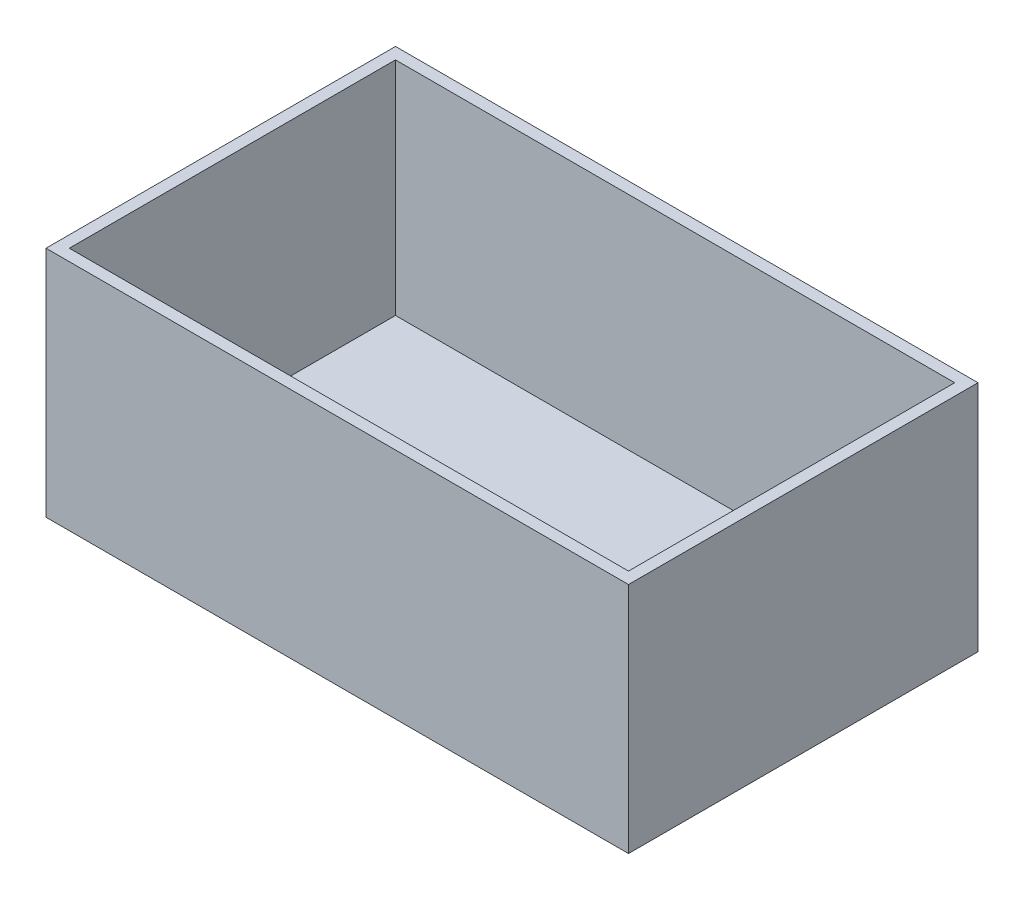
ISO-10303-21;
HEADER;
FILE_DESCRIPTION(('STEP AP214'),'2;1');
FILE_NAME('part.step','',(''),(''),'','','');
FILE_SCHEMA(('AUTOMOTIVE_DESIGN { 1 0 10303 214 1 1 1 1 }'));
ENDSEC;
DATA;
#1=APPLICATION_CONTEXT('core data for automotive mechanical design processes');
#2=APPLICATION_PROTOCOL_DEFINITION('international standard','automotive_design',2000,#1);
#3=PRODUCT_CONTEXT('',#1,'mechanical');
#4=PRODUCT('Part','Part','',(#3));
#5=PRODUCT_RELATED_PRODUCT_CATEGORY('part','',(#4));
#6=PRODUCT_DEFINITION_FORMATION('','',#4);
#7=PRODUCT_DEFINITION_CONTEXT('part definition',#1,'design');
#8=PRODUCT_DEFINITION('design','',#6,#7);
#9=PRODUCT_DEFINITION_SHAPE('','',#8);
#10=(LENGTH_UNIT() NAMED_UNIT(*) SI_UNIT(.MILLI.,.METRE.));
#11=(NAMED_UNIT(*) PLANE_ANGLE_UNIT() SI_UNIT($,.RADIAN.));
#12=(NAMED_UNIT(*) SI_UNIT($,.STERADIAN.) SOLID_ANGLE_UNIT());
#13=UNCERTAINTY_MEASURE_WITH_UNIT(LENGTH_MEASURE(1.E-05),#10,'distance_accuracy_value','');
#14=(GEOMETRIC_REPRESENTATION_CONTEXT(3) GLOBAL_UNCERTAINTY_ASSIGNED_CONTEXT((#13)) GLOBAL_UNIT_ASSIGNED_CONTEXT((#10,
#11,#12)) REPRESENTATION_CONTEXT('',''));
#15=CARTESIAN_POINT('',(0.,0.,0.));
#16=DIRECTION('',(0.,0.,1.));
#17=DIRECTION('',(1.,0.,0.));
#18=AXIS2_PLACEMENT_3D('',#15,#16,#17);
#19=CARTESIAN_POINT('',(-250.,100.,300.));
#20=DIRECTION('',(0.,-1.,0.));
#21=DIRECTION('',(0.,0.,-1.));
#22=AXIS2_PLACEMENT_3D('',#19,#20,#21);
#23=PLANE('',#22);
#24=DIRECTION('',(-1.,0.,0.));
#25=VECTOR('',#24,1.);
#26=CARTESIAN_POINT('',(-250.,100.,0.));
#27=LINE('',#26,#25);
#28=CARTESIAN_POINT('',(250.,100.,0.));
#29=VERTEX_POINT('',#28);
#30=CARTESIAN_POINT('',(-250.,100.,0.));
#31=VERTEX_POINT('',#30);
#32=EDGE_CURVE('E310',#29,#31,#27,.T.);
#33=ORIENTED_EDGE('',*,*,#32,.T.);
#34=DIRECTION('',(0.,0.,-1.));
#35=VECTOR('',#34,1.);
#36=CARTESIAN_POINT('',(-250.,100.,300.));
#37=LINE('',#36,#35);
#38=CARTESIAN_POINT('',(-250.,100.,300.));
#39=VERTEX_POINT('',#38);
#40=EDGE_CURVE('E48',#39,#31,#37,.T.);
#41=ORIENTED_EDGE('',*,*,#40,.F.);
#42=DIRECTION('',(-1.,0.,0.));
#43=VECTOR('',#42,1.);
#44=CARTESIAN_POINT('',(-250.,100.,300.));
#45=LINE('',#44,#43);
#46=CARTESIAN_POINT('',(250.,100.,300.));
#47=VERTEX_POINT('',#46);
#48=EDGE_CURVE('E296',#47,#39,#45,.T.);
#49=ORIENTED_EDGE('',*,*,#48,.F.);
#50=DIRECTION('',(0.,0.,-1.));
#51=VECTOR('',#50,1.);
#52=CARTESIAN_POINT('',(250.,100.,300.));
#53=LINE('',#52,#51);
#54=EDGE_CURVE('E11',#47,#29,#53,.T.);
#55=ORIENTED_EDGE('',*,*,#54,.T.);
#56=EDGE_LOOP('',(#33,#41,#49,#55));
#57=FACE_BOUND('',#56,.T.);
#58=DIRECTION('',(-1.,0.,0.));
#59=VECTOR('',#58,1.);
#60=CARTESIAN_POINT('',(0.,100.,10.));
#61=LINE('',#60,#59);
#62=CARTESIAN_POINT('',(240.,100.,10.));
#63=VERTEX_POINT('',#62);
#64=CARTESIAN_POINT('',(-240.,100.,10.));
#65=VERTEX_POINT('',#64);
#66=EDGE_CURVE('E180',#63,#65,#61,.T.);
#67=ORIENTED_EDGE('',*,*,#66,.F.);
#68=DIRECTION('',(0.,0.,-1.));
#69=VECTOR('',#68,1.);
#70=CARTESIAN_POINT('',(240.,100.,300.));
#71=LINE('',#70,#69);
#72=CARTESIAN_POINT('',(240.,100.,290.));
#73=VERTEX_POINT('',#72);
#74=EDGE_CURVE('E178',#73,#63,#71,.T.);
#75=ORIENTED_EDGE('',*,*,#74,.F.);
#76=DIRECTION('',(-1.,0.,0.));
#77=VECTOR('',#76,1.);
#78=CARTESIAN_POINT('',(0.,100.,290.));
#79=LINE('',#78,#77);
#80=CARTESIAN_POINT('',(-240.,100.,290.));
#81=VERTEX_POINT('',#80);
#82=EDGE_CURVE('E186',#73,#81,#79,.T.);
#83=ORIENTED_EDGE('',*,*,#82,.T.);
#84=DIRECTION('',(0.,0.,-1.));
#85=VECTOR('',#84,1.);
#86=CARTESIAN_POINT('',(-240.,100.,300.));
#87=LINE('',#86,#85);
#88=EDGE_CURVE('E193',#81,#65,#87,.T.);
#89=ORIENTED_EDGE('',*,*,#88,.T.);
#90=EDGE_LOOP('',(#67,#75,#83,#89));
#91=FACE_BOUND('',#90,.T.);
#92=ADVANCED_FACE('F39',(#57,#91),#23,.F.);
#93=CARTESIAN_POINT('',(250.,-100.,300.));
#94=DIRECTION('',(-1.,0.,0.));
#95=DIRECTION('',(0.,0.,1.));
#96=AXIS2_PLACEMENT_3D('',#93,#94,#95);
#97=PLANE('',#96);
#98=DIRECTION('',(0.,1.,0.));
#99=VECTOR('',#98,1.);
#100=CARTESIAN_POINT('',(250.,-100.,0.));
#101=LINE('',#100,#99);
#102=CARTESIAN_POINT('',(250.,-100.,0.));
#103=VERTEX_POINT('',#102);
#104=EDGE_CURVE('E268',#103,#29,#101,.T.);
#105=ORIENTED_EDGE('',*,*,#104,.T.);
#106=ORIENTED_EDGE('',*,*,#54,.F.);
#107=DIRECTION('',(0.,1.,0.));
#108=VECTOR('',#107,1.);
#109=CARTESIAN_POINT('',(250.,-100.,300.));
#110=LINE('',#109,#108);
#111=CARTESIAN_POINT('',(250.,-100.,300.));
#112=VERTEX_POINT('',#111);
#113=EDGE_CURVE('E292',#112,#47,#110,.T.);
#114=ORIENTED_EDGE('',*,*,#113,.F.);
#115=DIRECTION('',(0.,0.,-1.));
#116=VECTOR('',#115,1.);
#117=CARTESIAN_POINT('',(250.,-100.,300.));
#118=LINE('',#117,#116);
#119=EDGE_CURVE('E306',#112,#103,#118,.T.);
#120=ORIENTED_EDGE('',*,*,#119,.T.);
#121=EDGE_LOOP('',(#105,#106,#114,#120));
#122=FACE_BOUND('',#121,.T.);
#123=ADVANCED_FACE('F41',(#122),#97,.F.);
#124=CARTESIAN_POINT('',(-250.,-100.,300.));
#125=DIRECTION('',(1.,0.,0.));
#126=DIRECTION('',(0.,0.,-1.));
#127=AXIS2_PLACEMENT_3D('',#124,#125,#126);
#128=PLANE('',#127);
#129=DIRECTION('',(0.,-1.,0.));
#130=VECTOR('',#129,1.);
#131=CARTESIAN_POINT('',(-250.,-100.,0.));
#132=LINE('',#131,#130);
#133=CARTESIAN_POINT('',(-250.,-100.,0.));
#134=VERTEX_POINT('',#133);
#135=EDGE_CURVE('E313',#31,#134,#132,.T.);
#136=ORIENTED_EDGE('',*,*,#135,.T.);
#137=DIRECTION('',(0.,0.,-1.));
#138=VECTOR('',#137,1.);
#139=CARTESIAN_POINT('',(-250.,-100.,300.));
#140=LINE('',#139,#138);
#141=CARTESIAN_POINT('',(-250.,-100.,300.));
#142=VERTEX_POINT('',#141);
#143=EDGE_CURVE('E321',#142,#134,#140,.T.);
#144=ORIENTED_EDGE('',*,*,#143,.F.);
#145=DIRECTION('',(0.,-1.,0.));
#146=VECTOR('',#145,1.);
#147=CARTESIAN_POINT('',(-250.,-100.,300.));
#148=LINE('',#147,#146);
#149=EDGE_CURVE('E300',#39,#142,#148,.T.);
#150=ORIENTED_EDGE('',*,*,#149,.F.);
#151=ORIENTED_EDGE('',*,*,#40,.T.);
#152=EDGE_LOOP('',(#136,#144,#150,#151));
#153=FACE_BOUND('',#152,.T.);
#154=ADVANCED_FACE('F330',(#153),#128,.F.);
#155=CARTESIAN_POINT('',(-250.,-100.,300.));
#156=DIRECTION('',(0.,1.,0.));
#157=DIRECTION('',(0.,0.,1.));
#158=AXIS2_PLACEMENT_3D('',#155,#156,#157);
#159=PLANE('',#158);
#160=DIRECTION('',(1.,0.,0.));
#161=VECTOR('',#160,1.);
#162=CARTESIAN_POINT('',(-250.,-100.,0.));
#163=LINE('',#162,#161);
#164=EDGE_CURVE('E297',#134,#103,#163,.T.);
#165=ORIENTED_EDGE('',*,*,#164,.T.);
#166=ORIENTED_EDGE('',*,*,#119,.F.);
#167=DIRECTION('',(1.,0.,0.));
#168=VECTOR('',#167,1.);
#169=CARTESIAN_POINT('',(-250.,-100.,300.));
#170=LINE('',#169,#168);
#171=EDGE_CURVE('E303',#142,#112,#170,.T.);
#172=ORIENTED_EDGE('',*,*,#171,.F.);
#173=ORIENTED_EDGE('',*,*,#143,.T.);
#174=EDGE_LOOP('',(#165,#166,#172,#173));
#175=FACE_BOUND('',#174,.T.);
#176=ADVANCED_FACE('F339',(#175),#159,.F.);
#177=CARTESIAN_POINT('',(0.,0.,300.));
#178=DIRECTION('',(0.,0.,-1.));
#179=DIRECTION('',(-1.,0.,0.));
#180=AXIS2_PLACEMENT_3D('',#177,#178,#179);
#181=PLANE('',#180);
#182=ORIENTED_EDGE('',*,*,#113,.T.);
#183=ORIENTED_EDGE('',*,*,#48,.T.);
#184=ORIENTED_EDGE('',*,*,#149,.T.);
#185=ORIENTED_EDGE('',*,*,#171,.T.);
#186=EDGE_LOOP('',(#182,#183,#184,#185));
#187=FACE_BOUND('',#186,.T.);
#188=ADVANCED_FACE('F345',(#187),#181,.F.);
#189=CARTESIAN_POINT('',(0.,0.,0.));
#190=DIRECTION('',(0.,0.,-1.));
#191=DIRECTION('',(-1.,0.,0.));
#192=AXIS2_PLACEMENT_3D('',#189,#190,#191);
#193=PLANE('',#192);
#194=DIRECTION('',(1.,0.,0.));
#195=VECTOR('',#194,1.);
#196=CARTESIAN_POINT('',(35.,-20.,0.));
#197=LINE('',#196,#195);
#198=CARTESIAN_POINT('',(25.,-20.,0.));
#199=VERTEX_POINT('',#198);
#200=CARTESIAN_POINT('',(35.,-20.,0.));
#201=VERTEX_POINT('',#200);
#202=EDGE_CURVE('E232',#199,#201,#197,.T.);
#203=ORIENTED_EDGE('',*,*,#202,.T.);
#204=DIRECTION('',(0.,1.,0.));
#205=VECTOR('',#204,1.);
#206=CARTESIAN_POINT('',(35.,-20.,0.));
#207=LINE('',#206,#205);
#208=CARTESIAN_POINT('',(35.,20.,0.));
#209=VERTEX_POINT('',#208);
#210=EDGE_CURVE('E264',#201,#209,#207,.T.);
#211=ORIENTED_EDGE('',*,*,#210,.T.);
#212=DIRECTION('',(1.,0.,0.));
#213=VECTOR('',#212,1.);
#214=CARTESIAN_POINT('',(35.,20.,0.));
#215=LINE('',#214,#213);
#216=CARTESIAN_POINT('',(25.,20.,0.));
#217=VERTEX_POINT('',#216);
#218=EDGE_CURVE('E199',#217,#209,#215,.T.);
#219=ORIENTED_EDGE('',*,*,#218,.F.);
#220=DIRECTION('',(0.,1.,0.));
#221=VECTOR('',#220,1.);
#222=CARTESIAN_POINT('',(25.,-20.,0.));
#223=LINE('',#222,#221);
#224=EDGE_CURVE('E265',#199,#217,#223,.T.);
#225=ORIENTED_EDGE('',*,*,#224,.F.);
#226=EDGE_LOOP('',(#203,#211,#219,#225));
#227=FACE_BOUND('',#226,.T.);
#228=DIRECTION('',(1.,0.,0.));
#229=VECTOR('',#228,1.);
#230=CARTESIAN_POINT('',(-35.,-20.,0.));
#231=LINE('',#230,#229);
#232=CARTESIAN_POINT('',(-35.,-20.,0.));
#233=VERTEX_POINT('',#232);
#234=CARTESIAN_POINT('',(-24.9999999999999,-20.,0.));
#235=VERTEX_POINT('',#234);
#236=EDGE_CURVE('E248',#233,#235,#231,.T.);
#237=ORIENTED_EDGE('',*,*,#236,.T.);
#238=DIRECTION('',(0.,1.,0.));
#239=VECTOR('',#238,1.);
#240=CARTESIAN_POINT('',(-24.9999999999999,-20.,0.));
#241=LINE('',#240,#239);
#242=CARTESIAN_POINT('',(-24.9999999999999,20.,0.));
#243=VERTEX_POINT('',#242);
#244=EDGE_CURVE('E275',#235,#243,#241,.T.);
#245=ORIENTED_EDGE('',*,*,#244,.T.);
#246=DIRECTION('',(1.,0.,0.));
#247=VECTOR('',#246,1.);
#248=CARTESIAN_POINT('',(-35.,20.,0.));
#249=LINE('',#248,#247);
#250=CARTESIAN_POINT('',(-35.,20.,0.));
#251=VERTEX_POINT('',#250);
#252=EDGE_CURVE('E220',#251,#243,#249,.T.);
#253=ORIENTED_EDGE('',*,*,#252,.F.);
#254=DIRECTION('',(0.,1.,0.));
#255=VECTOR('',#254,1.);
#256=CARTESIAN_POINT('',(-35.,-20.,0.));
#257=LINE('',#256,#255);
#258=EDGE_CURVE('E279',#233,#251,#257,.T.);
#259=ORIENTED_EDGE('',*,*,#258,.F.);
#260=EDGE_LOOP('',(#237,#245,#253,#259));
#261=FACE_BOUND('',#260,.T.);
#262=ORIENTED_EDGE('',*,*,#104,.F.);
#263=ORIENTED_EDGE('',*,*,#164,.F.);
#264=ORIENTED_EDGE('',*,*,#135,.F.);
#265=ORIENTED_EDGE('',*,*,#32,.F.);
#266=EDGE_LOOP('',(#262,#263,#264,#265));
#267=FACE_BOUND('',#266,.T.);
#268=ADVANCED_FACE('F336',(#227,#261,#267),#193,.T.);
#269=CARTESIAN_POINT('',(25.,-20.,0.));
#270=DIRECTION('',(-1.,0.,0.));
#271=DIRECTION('',(0.,0.,1.));
#272=AXIS2_PLACEMENT_3D('',#269,#270,#271);
#273=PLANE('',#272);
#274=ORIENTED_EDGE('',*,*,#224,.T.);
#275=DIRECTION('',(0.,0.,1.));
#276=VECTOR('',#275,1.);
#277=CARTESIAN_POINT('',(25.,20.,0.));
#278=LINE('',#277,#276);
#279=CARTESIAN_POINT('',(25.,20.,-30.));
#280=VERTEX_POINT('',#279);
#281=EDGE_CURVE('E63',#280,#217,#278,.T.);
#282=ORIENTED_EDGE('',*,*,#281,.F.);
#283=DIRECTION('',(0.,1.,0.));
#284=VECTOR('',#283,1.);
#285=CARTESIAN_POINT('',(25.,-20.,-30.));
#286=LINE('',#285,#284);
#287=CARTESIAN_POINT('',(25.,-20.,-30.));
#288=VERTEX_POINT('',#287);
#289=EDGE_CURVE('E269',#288,#280,#286,.T.);
#290=ORIENTED_EDGE('',*,*,#289,.F.);
#291=DIRECTION('',(0.,0.,1.));
#292=VECTOR('',#291,1.);
#293=CARTESIAN_POINT('',(25.,-20.,0.));
#294=LINE('',#293,#292);
#295=EDGE_CURVE('E260',#288,#199,#294,.T.);
#296=ORIENTED_EDGE('',*,*,#295,.T.);
#297=EDGE_LOOP('',(#274,#282,#290,#296));
#298=FACE_BOUND('',#297,.T.);
#299=ADVANCED_FACE('F371',(#298),#273,.T.);
#300=CARTESIAN_POINT('',(25.,-20.,-30.));
#301=DIRECTION('',(0.,0.,1.));
#302=DIRECTION('',(1.,0.,0.));
#303=AXIS2_PLACEMENT_3D('',#300,#301,#302);
#304=PLANE('',#303);
#305=ORIENTED_EDGE('',*,*,#289,.T.);
#306=DIRECTION('',(1.,0.,0.));
#307=VECTOR('',#306,1.);
#308=CARTESIAN_POINT('',(25.,20.,-30.));
#309=LINE('',#308,#307);
#310=CARTESIAN_POINT('',(-25.,20.,-30.));
#311=VERTEX_POINT('',#310);
#312=EDGE_CURVE('E227',#311,#280,#309,.T.);
#313=ORIENTED_EDGE('',*,*,#312,.F.);
#314=DIRECTION('',(0.,1.,0.));
#315=VECTOR('',#314,1.);
#316=CARTESIAN_POINT('',(-25.,-20.,-30.));
#317=LINE('',#316,#315);
#318=CARTESIAN_POINT('',(-25.,-20.,-30.));
#319=VERTEX_POINT('',#318);
#320=EDGE_CURVE('E272',#319,#311,#317,.T.);
#321=ORIENTED_EDGE('',*,*,#320,.F.);
#322=DIRECTION('',(1.,0.,0.));
#323=VECTOR('',#322,1.);
#324=CARTESIAN_POINT('',(25.,-20.,-30.));
#325=LINE('',#324,#323);
#326=EDGE_CURVE('E256',#319,#288,#325,.T.);
#327=ORIENTED_EDGE('',*,*,#326,.T.);
#328=EDGE_LOOP('',(#305,#313,#321,#327));
#329=FACE_BOUND('',#328,.T.);
#330=ADVANCED_FACE('F374',(#329),#304,.T.);
#331=CARTESIAN_POINT('',(-24.9999999999999,-20.,0.));
#332=DIRECTION('',(1.,0.,0.));
#333=DIRECTION('',(0.,0.,-1.));
#334=AXIS2_PLACEMENT_3D('',#331,#332,#333);
#335=PLANE('',#334);
#336=ORIENTED_EDGE('',*,*,#320,.T.);
#337=DIRECTION('',(0.,0.,-1.));
#338=VECTOR('',#337,1.);
#339=CARTESIAN_POINT('',(-24.9999999999999,20.,0.));
#340=LINE('',#339,#338);
#341=EDGE_CURVE('E223',#243,#311,#340,.T.);
#342=ORIENTED_EDGE('',*,*,#341,.F.);
#343=ORIENTED_EDGE('',*,*,#244,.F.);
#344=DIRECTION('',(0.,0.,-1.));
#345=VECTOR('',#344,1.);
#346=CARTESIAN_POINT('',(-24.9999999999999,-20.,0.));
#347=LINE('',#346,#345);
#348=EDGE_CURVE('E252',#235,#319,#347,.T.);
#349=ORIENTED_EDGE('',*,*,#348,.T.);
#350=EDGE_LOOP('',(#336,#342,#343,#349));
#351=FACE_BOUND('',#350,.T.);
#352=ADVANCED_FACE('F378',(#351),#335,.T.);
#353=CARTESIAN_POINT('',(-35.,-20.,0.));
#354=DIRECTION('',(-1.,0.,0.));
#355=DIRECTION('',(0.,0.,1.));
#356=AXIS2_PLACEMENT_3D('',#353,#354,#355);
#357=PLANE('',#356);
#358=ORIENTED_EDGE('',*,*,#258,.T.);
#359=DIRECTION('',(0.,0.,1.));
#360=VECTOR('',#359,1.);
#361=CARTESIAN_POINT('',(-35.,20.,0.));
#362=LINE('',#361,#360);
#363=CARTESIAN_POINT('',(-35.,20.,-40.));
#364=VERTEX_POINT('',#363);
#365=EDGE_CURVE('E217',#364,#251,#362,.T.);
#366=ORIENTED_EDGE('',*,*,#365,.F.);
#367=DIRECTION('',(0.,1.,0.));
#368=VECTOR('',#367,1.);
#369=CARTESIAN_POINT('',(-35.,-20.,-40.));
#370=LINE('',#369,#368);
#371=CARTESIAN_POINT('',(-35.,-20.,-40.));
#372=VERTEX_POINT('',#371);
#373=EDGE_CURVE('E283',#372,#364,#370,.T.);
#374=ORIENTED_EDGE('',*,*,#373,.F.);
#375=DIRECTION('',(0.,0.,1.));
#376=VECTOR('',#375,1.);
#377=CARTESIAN_POINT('',(-35.,-20.,0.));
#378=LINE('',#377,#376);
#379=EDGE_CURVE('E244',#372,#233,#378,.T.);
#380=ORIENTED_EDGE('',*,*,#379,.T.);
#381=EDGE_LOOP('',(#358,#366,#374,#380));
#382=FACE_BOUND('',#381,.T.);
#383=ADVANCED_FACE('F382',(#382),#357,.T.);
#384=CARTESIAN_POINT('',(35.,-20.,-40.));
#385=DIRECTION('',(0.,0.,-1.));
#386=DIRECTION('',(-1.,0.,0.));
#387=AXIS2_PLACEMENT_3D('',#384,#385,#386);
#388=PLANE('',#387);
#389=ORIENTED_EDGE('',*,*,#373,.T.);
#390=DIRECTION('',(-1.,0.,0.));
#391=VECTOR('',#390,1.);
#392=CARTESIAN_POINT('',(35.,20.,-40.));
#393=LINE('',#392,#391);
#394=CARTESIAN_POINT('',(35.,20.,-40.));
#395=VERTEX_POINT('',#394);
#396=EDGE_CURVE('E213',#395,#364,#393,.T.);
#397=ORIENTED_EDGE('',*,*,#396,.F.);
#398=DIRECTION('',(0.,1.,0.));
#399=VECTOR('',#398,1.);
#400=CARTESIAN_POINT('',(35.,-20.,-40.));
#401=LINE('',#400,#399);
#402=CARTESIAN_POINT('',(35.,-20.,-40.));
#403=VERTEX_POINT('',#402);
#404=EDGE_CURVE('E286',#403,#395,#401,.T.);
#405=ORIENTED_EDGE('',*,*,#404,.F.);
#406=DIRECTION('',(-1.,0.,0.));
#407=VECTOR('',#406,1.);
#408=CARTESIAN_POINT('',(35.,-20.,-40.));
#409=LINE('',#408,#407);
#410=EDGE_CURVE('E240',#403,#372,#409,.T.);
#411=ORIENTED_EDGE('',*,*,#410,.T.);
#412=EDGE_LOOP('',(#389,#397,#405,#411));
#413=FACE_BOUND('',#412,.T.);
#414=ADVANCED_FACE('F386',(#413),#388,.T.);
#415=CARTESIAN_POINT('',(35.,-20.,0.));
#416=DIRECTION('',(1.,0.,0.));
#417=DIRECTION('',(0.,0.,-1.));
#418=AXIS2_PLACEMENT_3D('',#415,#416,#417);
#419=PLANE('',#418);
#420=ORIENTED_EDGE('',*,*,#404,.T.);
#421=DIRECTION('',(0.,0.,-1.));
#422=VECTOR('',#421,1.);
#423=CARTESIAN_POINT('',(35.,20.,0.));
#424=LINE('',#423,#422);
#425=EDGE_CURVE('E209',#209,#395,#424,.T.);
#426=ORIENTED_EDGE('',*,*,#425,.F.);
#427=ORIENTED_EDGE('',*,*,#210,.F.);
#428=DIRECTION('',(0.,0.,-1.));
#429=VECTOR('',#428,1.);
#430=CARTESIAN_POINT('',(35.,-20.,0.));
#431=LINE('',#430,#429);
#432=EDGE_CURVE('E236',#201,#403,#431,.T.);
#433=ORIENTED_EDGE('',*,*,#432,.T.);
#434=EDGE_LOOP('',(#420,#426,#427,#433));
#435=FACE_BOUND('',#434,.T.);
#436=ADVANCED_FACE('F369',(#435),#419,.T.);
#437=CARTESIAN_POINT('',(0.,-20.,0.));
#438=DIRECTION('',(0.,-1.,0.));
#439=DIRECTION('',(0.,0.,-1.));
#440=AXIS2_PLACEMENT_3D('',#437,#438,#439);
#441=PLANE('',#440);
#442=ORIENTED_EDGE('',*,*,#202,.F.);
#443=ORIENTED_EDGE('',*,*,#295,.F.);
#444=ORIENTED_EDGE('',*,*,#326,.F.);
#445=ORIENTED_EDGE('',*,*,#348,.F.);
#446=ORIENTED_EDGE('',*,*,#236,.F.);
#447=ORIENTED_EDGE('',*,*,#379,.F.);
#448=ORIENTED_EDGE('',*,*,#410,.F.);
#449=ORIENTED_EDGE('',*,*,#432,.F.);
#450=EDGE_LOOP('',(#442,#443,#444,#445,#446,#447,#448,#449));
#451=FACE_BOUND('',#450,.T.);
#452=ADVANCED_FACE('F366',(#451),#441,.T.);
#453=CARTESIAN_POINT('',(0.,20.,0.));
#454=DIRECTION('',(0.,-1.,0.));
#455=DIRECTION('',(0.,0.,-1.));
#456=AXIS2_PLACEMENT_3D('',#453,#454,#455);
#457=PLANE('',#456);
#458=ORIENTED_EDGE('',*,*,#218,.T.);
#459=ORIENTED_EDGE('',*,*,#425,.T.);
#460=ORIENTED_EDGE('',*,*,#396,.T.);
#461=ORIENTED_EDGE('',*,*,#365,.T.);
#462=ORIENTED_EDGE('',*,*,#252,.T.);
#463=ORIENTED_EDGE('',*,*,#341,.T.);
#464=ORIENTED_EDGE('',*,*,#312,.T.);
#465=ORIENTED_EDGE('',*,*,#281,.T.);
#466=EDGE_LOOP('',(#458,#459,#460,#461,#462,#463,#464,#465));
#467=FACE_BOUND('',#466,.T.);
#468=ADVANCED_FACE('F363',(#467),#457,.F.);
#469=CARTESIAN_POINT('',(240.,-100.,300.));
#470=DIRECTION('',(-1.,0.,0.));
#471=DIRECTION('',(0.,0.,1.));
#472=AXIS2_PLACEMENT_3D('',#469,#470,#471);
#473=PLANE('',#472);
#474=DIRECTION('',(0.,1.,0.));
#475=VECTOR('',#474,1.);
#476=CARTESIAN_POINT('',(240.,0.,10.));
#477=LINE('',#476,#475);
#478=CARTESIAN_POINT('',(240.,-90.,10.));
#479=VERTEX_POINT('',#478);
#480=EDGE_CURVE('E160',#479,#63,#477,.T.);
#481=ORIENTED_EDGE('',*,*,#480,.F.);
#482=DIRECTION('',(0.,0.,-1.));
#483=VECTOR('',#482,1.);
#484=CARTESIAN_POINT('',(240.,-90.,300.));
#485=LINE('',#484,#483);
#486=CARTESIAN_POINT('',(240.,-90.,290.));
#487=VERTEX_POINT('',#486);
#488=EDGE_CURVE('E169',#487,#479,#485,.T.);
#489=ORIENTED_EDGE('',*,*,#488,.F.);
#490=DIRECTION('',(0.,1.,0.));
#491=VECTOR('',#490,1.);
#492=CARTESIAN_POINT('',(240.,0.,290.));
#493=LINE('',#492,#491);
#494=EDGE_CURVE('E55',#487,#73,#493,.T.);
#495=ORIENTED_EDGE('',*,*,#494,.T.);
#496=ORIENTED_EDGE('',*,*,#74,.T.);
#497=EDGE_LOOP('',(#481,#489,#495,#496));
#498=FACE_BOUND('',#497,.T.);
#499=ADVANCED_FACE('F176',(#498),#473,.T.);
#500=CARTESIAN_POINT('',(-240.,-100.,300.));
#501=DIRECTION('',(1.,0.,0.));
#502=DIRECTION('',(0.,0.,-1.));
#503=AXIS2_PLACEMENT_3D('',#500,#501,#502);
#504=PLANE('',#503);
#505=DIRECTION('',(0.,-1.,0.));
#506=VECTOR('',#505,1.);
#507=CARTESIAN_POINT('',(-240.,0.,10.));
#508=LINE('',#507,#506);
#509=CARTESIAN_POINT('',(-240.,-90.,10.));
#510=VERTEX_POINT('',#509);
#511=EDGE_CURVE('E163',#65,#510,#508,.T.);
#512=ORIENTED_EDGE('',*,*,#511,.F.);
#513=ORIENTED_EDGE('',*,*,#88,.F.);
#514=DIRECTION('',(0.,-1.,0.));
#515=VECTOR('',#514,1.);
#516=CARTESIAN_POINT('',(-240.,0.,290.));
#517=LINE('',#516,#515);
#518=CARTESIAN_POINT('',(-240.,-90.,290.));
#519=VERTEX_POINT('',#518);
#520=EDGE_CURVE('E190',#81,#519,#517,.T.);
#521=ORIENTED_EDGE('',*,*,#520,.T.);
#522=DIRECTION('',(0.,0.,-1.));
#523=VECTOR('',#522,1.);
#524=CARTESIAN_POINT('',(-240.,-90.,300.));
#525=LINE('',#524,#523);
#526=EDGE_CURVE('E174',#519,#510,#525,.T.);
#527=ORIENTED_EDGE('',*,*,#526,.T.);
#528=EDGE_LOOP('',(#512,#513,#521,#527));
#529=FACE_BOUND('',#528,.T.);
#530=ADVANCED_FACE('F349',(#529),#504,.T.);
#531=CARTESIAN_POINT('',(-250.,-90.,300.));
#532=DIRECTION('',(0.,1.,0.));
#533=DIRECTION('',(0.,0.,1.));
#534=AXIS2_PLACEMENT_3D('',#531,#532,#533);
#535=PLANE('',#534);
#536=DIRECTION('',(1.,0.,0.));
#537=VECTOR('',#536,1.);
#538=CARTESIAN_POINT('',(0.,-90.,10.));
#539=LINE('',#538,#537);
#540=EDGE_CURVE('E156',#510,#479,#539,.T.);
#541=ORIENTED_EDGE('',*,*,#540,.F.);
#542=ORIENTED_EDGE('',*,*,#526,.F.);
#543=DIRECTION('',(1.,0.,0.));
#544=VECTOR('',#543,1.);
#545=CARTESIAN_POINT('',(0.,-90.,290.));
#546=LINE('',#545,#544);
#547=EDGE_CURVE('E172',#519,#487,#546,.T.);
#548=ORIENTED_EDGE('',*,*,#547,.T.);
#549=ORIENTED_EDGE('',*,*,#488,.T.);
#550=EDGE_LOOP('',(#541,#542,#548,#549));
#551=FACE_BOUND('',#550,.T.);
#552=ADVANCED_FACE('F170',(#551),#535,.T.);
#553=CARTESIAN_POINT('',(0.,0.,290.));
#554=DIRECTION('',(0.,0.,-1.));
#555=DIRECTION('',(-1.,0.,0.));
#556=AXIS2_PLACEMENT_3D('',#553,#554,#555);
#557=PLANE('',#556);
#558=ORIENTED_EDGE('',*,*,#494,.F.);
#559=ORIENTED_EDGE('',*,*,#547,.F.);
#560=ORIENTED_EDGE('',*,*,#520,.F.);
#561=ORIENTED_EDGE('',*,*,#82,.F.);
#562=EDGE_LOOP('',(#558,#559,#560,#561));
#563=FACE_BOUND('',#562,.T.);
#564=ADVANCED_FACE('F352',(#563),#557,.T.);
#565=CARTESIAN_POINT('',(0.,0.,10.));
#566=DIRECTION('',(0.,0.,-1.));
#567=DIRECTION('',(-1.,0.,0.));
#568=AXIS2_PLACEMENT_3D('',#565,#566,#567);
#569=PLANE('',#568);
#570=ORIENTED_EDGE('',*,*,#480,.T.);
#571=ORIENTED_EDGE('',*,*,#66,.T.);
#572=ORIENTED_EDGE('',*,*,#511,.T.);
#573=ORIENTED_EDGE('',*,*,#540,.T.);
#574=EDGE_LOOP('',(#570,#571,#572,#573));
#575=FACE_BOUND('',#574,.T.);
#576=ADVANCED_FACE('F158',(#575),#569,.F.);
#577=CLOSED_SHELL('',(#92,#123,#154,#176,#188,#268,#299,#330,#352,#383,#414,#436,#452,#468,#499,
#530,#552,#564,#576));
#578=MANIFOLD_SOLID_BREP('B2',#577);
#579=ADVANCED_BREP_SHAPE_REPRESENTATION('',(#18,#578),#14);
#580=SHAPE_DEFINITION_REPRESENTATION(#9,#579);
ENDSEC;
END-ISO-10303-21;
